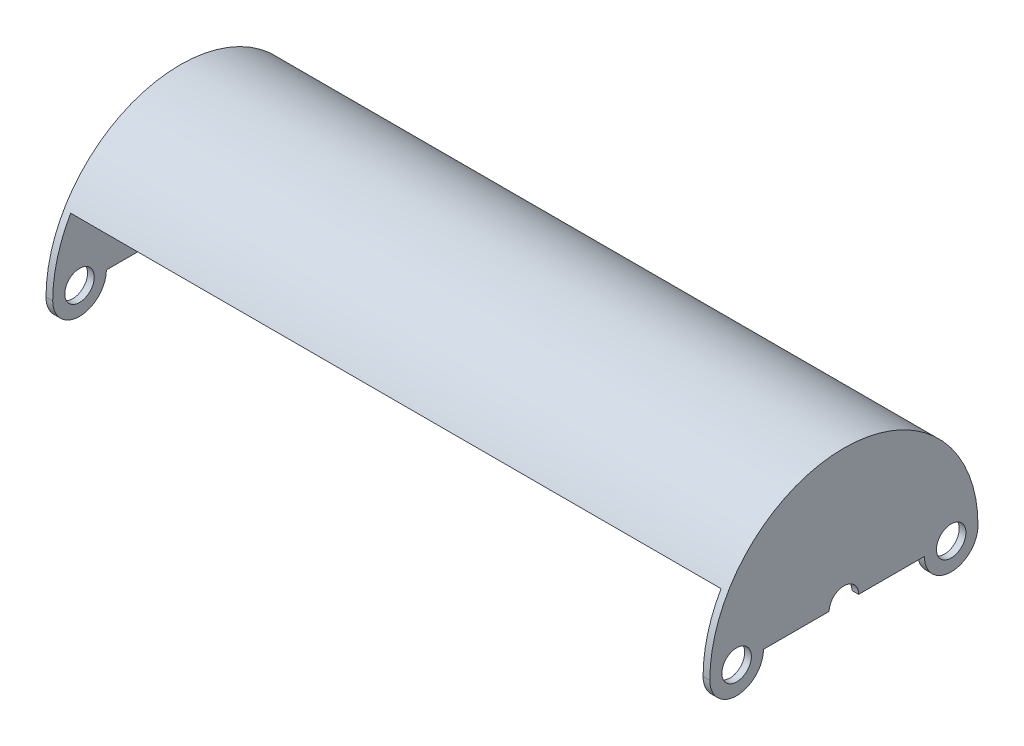
ISO-10303-21;
HEADER;
FILE_DESCRIPTION(('STEP AP214'),'2;1');
FILE_NAME('part.step','',(''),(''),'','','');
FILE_SCHEMA(('AUTOMOTIVE_DESIGN { 1 0 10303 214 1 1 1 1 }'));
ENDSEC;
DATA;
#1=APPLICATION_CONTEXT('core data for automotive mechanical design processes');
#2=APPLICATION_PROTOCOL_DEFINITION('international standard','automotive_design',2000,#1);
#3=PRODUCT_CONTEXT('',#1,'mechanical');
#4=PRODUCT('Part','Part','',(#3));
#5=PRODUCT_RELATED_PRODUCT_CATEGORY('part','',(#4));
#6=PRODUCT_DEFINITION_FORMATION('','',#4);
#7=PRODUCT_DEFINITION_CONTEXT('part definition',#1,'design');
#8=PRODUCT_DEFINITION('design','',#6,#7);
#9=PRODUCT_DEFINITION_SHAPE('','',#8);
#10=(LENGTH_UNIT() NAMED_UNIT(*) SI_UNIT(.MILLI.,.METRE.));
#11=(NAMED_UNIT(*) PLANE_ANGLE_UNIT() SI_UNIT($,.RADIAN.));
#12=(NAMED_UNIT(*) SI_UNIT($,.STERADIAN.) SOLID_ANGLE_UNIT());
#13=UNCERTAINTY_MEASURE_WITH_UNIT(LENGTH_MEASURE(1.E-05),#10,'distance_accuracy_value','');
#14=(GEOMETRIC_REPRESENTATION_CONTEXT(3) GLOBAL_UNCERTAINTY_ASSIGNED_CONTEXT((#13)) GLOBAL_UNIT_ASSIGNED_CONTEXT((#10,
#11,#12)) REPRESENTATION_CONTEXT('',''));
#15=CARTESIAN_POINT('',(0.,0.,0.));
#16=DIRECTION('',(0.,0.,1.));
#17=DIRECTION('',(1.,0.,0.));
#18=AXIS2_PLACEMENT_3D('',#15,#16,#17);
#19=CARTESIAN_POINT('',(76.99375,0.,0.));
#20=DIRECTION('',(-1.,0.,0.));
#21=DIRECTION('',(0.,0.,1.));
#22=AXIS2_PLACEMENT_3D('',#19,#20,#21);
#23=CYLINDRICAL_SURFACE('',#22,30.1625);
#24=CARTESIAN_POINT('',(-76.99375,0.,0.));
#25=DIRECTION('',(1.,0.,0.));
#26=DIRECTION('',(0.,0.,-1.));
#27=AXIS2_PLACEMENT_3D('',#24,#25,#26);
#28=CIRCLE('',#27,30.1625);
#29=CARTESIAN_POINT('',(-76.99375,0.,-30.1625));
#30=VERTEX_POINT('',#29);
#31=CARTESIAN_POINT('',(-76.99375,15.0812499999998,26.1214912416482));
#32=VERTEX_POINT('',#31);
#33=EDGE_CURVE('E306',#30,#32,#28,.T.);
#34=ORIENTED_EDGE('',*,*,#33,.F.);
#35=DIRECTION('',(-1.,0.,0.));
#36=VECTOR('',#35,1.);
#37=CARTESIAN_POINT('',(76.99375,0.,-30.1625));
#38=LINE('',#37,#36);
#39=CARTESIAN_POINT('',(76.99375,0.,-30.1625));
#40=VERTEX_POINT('',#39);
#41=EDGE_CURVE('E11',#40,#30,#38,.T.);
#42=ORIENTED_EDGE('',*,*,#41,.F.);
#43=CARTESIAN_POINT('',(76.99375,0.,0.));
#44=DIRECTION('',(1.,0.,0.));
#45=DIRECTION('',(0.,0.,-1.));
#46=AXIS2_PLACEMENT_3D('',#43,#44,#45);
#47=CIRCLE('',#46,30.1625);
#48=CARTESIAN_POINT('',(76.99375,15.0812499999998,26.1214912416482));
#49=VERTEX_POINT('',#48);
#50=EDGE_CURVE('E307',#40,#49,#47,.T.);
#51=ORIENTED_EDGE('',*,*,#50,.T.);
#52=DIRECTION('',(-1.,0.,0.));
#53=VECTOR('',#52,1.);
#54=CARTESIAN_POINT('',(76.99375,15.0812499999998,26.1214912416482));
#55=LINE('',#54,#53);
#56=EDGE_CURVE('E319',#49,#32,#55,.T.);
#57=ORIENTED_EDGE('',*,*,#56,.T.);
#58=EDGE_LOOP('',(#34,#42,#51,#57));
#59=FACE_BOUND('',#58,.T.);
#60=ADVANCED_FACE('F45',(#59),#23,.F.);
#61=CARTESIAN_POINT('',(76.99375,0.,0.));
#62=DIRECTION('',(0.,1.,0.));
#63=DIRECTION('',(0.,0.,1.));
#64=AXIS2_PLACEMENT_3D('',#61,#62,#63);
#65=PLANE('',#64);
#66=DIRECTION('',(0.,0.,-1.));
#67=VECTOR('',#66,1.);
#68=CARTESIAN_POINT('',(-76.99375,0.,0.));
#69=LINE('',#68,#67);
#70=CARTESIAN_POINT('',(-76.99375,0.,-31.75));
#71=VERTEX_POINT('',#70);
#72=EDGE_CURVE('E322',#30,#71,#69,.T.);
#73=ORIENTED_EDGE('',*,*,#72,.T.);
#74=DIRECTION('',(-1.,0.,0.));
#75=VECTOR('',#74,1.);
#76=CARTESIAN_POINT('',(76.99375,0.,-31.75));
#77=LINE('',#76,#75);
#78=CARTESIAN_POINT('',(76.99375,0.,-31.75));
#79=VERTEX_POINT('',#78);
#80=EDGE_CURVE('E54',#79,#71,#77,.T.);
#81=ORIENTED_EDGE('',*,*,#80,.F.);
#82=DIRECTION('',(0.,0.,-1.));
#83=VECTOR('',#82,1.);
#84=CARTESIAN_POINT('',(76.99375,0.,0.));
#85=LINE('',#84,#83);
#86=EDGE_CURVE('E311',#40,#79,#85,.T.);
#87=ORIENTED_EDGE('',*,*,#86,.F.);
#88=ORIENTED_EDGE('',*,*,#41,.T.);
#89=EDGE_LOOP('',(#73,#81,#87,#88));
#90=FACE_BOUND('',#89,.T.);
#91=ADVANCED_FACE('F340',(#90),#65,.F.);
#92=CARTESIAN_POINT('',(76.99375,0.,0.));
#93=DIRECTION('',(-1.,0.,0.));
#94=DIRECTION('',(0.,0.,1.));
#95=AXIS2_PLACEMENT_3D('',#92,#93,#94);
#96=CYLINDRICAL_SURFACE('',#95,31.75);
#97=ORIENTED_EDGE('',*,*,#80,.T.);
#98=DIRECTION('',(1.,0.,0.));
#99=VECTOR('',#98,1.);
#100=CARTESIAN_POINT('',(-78.58125,0.,-31.75));
#101=LINE('',#100,#99);
#102=CARTESIAN_POINT('',(-78.58125,0.,-31.75));
#103=VERTEX_POINT('',#102);
#104=EDGE_CURVE('E161',#103,#71,#101,.T.);
#105=ORIENTED_EDGE('',*,*,#104,.F.);
#106=CARTESIAN_POINT('',(-78.58125,0.,0.));
#107=DIRECTION('',(1.,0.,0.));
#108=DIRECTION('',(0.,0.,-1.));
#109=AXIS2_PLACEMENT_3D('',#106,#107,#108);
#110=CIRCLE('',#109,31.75);
#111=CARTESIAN_POINT('',(-78.58125,-2.78108394667497E-13,31.75));
#112=VERTEX_POINT('',#111);
#113=EDGE_CURVE('E167',#103,#112,#110,.T.);
#114=ORIENTED_EDGE('',*,*,#113,.T.);
#115=DIRECTION('',(1.,0.,0.));
#116=VECTOR('',#115,1.);
#117=CARTESIAN_POINT('',(-78.58125,-2.78108394667497E-13,31.75));
#118=LINE('',#117,#116);
#119=CARTESIAN_POINT('',(-76.99375,-2.78108394667497E-13,31.75));
#120=VERTEX_POINT('',#119);
#121=EDGE_CURVE('E149',#112,#120,#118,.T.);
#122=ORIENTED_EDGE('',*,*,#121,.T.);
#123=CARTESIAN_POINT('',(-76.99375,0.,0.));
#124=DIRECTION('',(1.,0.,0.));
#125=DIRECTION('',(0.,0.,-1.));
#126=AXIS2_PLACEMENT_3D('',#123,#124,#125);
#127=CIRCLE('',#126,31.75);
#128=CARTESIAN_POINT('',(-76.99375,15.8749999999998,27.496306570156));
#129=VERTEX_POINT('',#128);
#130=EDGE_CURVE('E198',#129,#120,#127,.T.);
#131=ORIENTED_EDGE('',*,*,#130,.F.);
#132=DIRECTION('',(-1.,0.,0.));
#133=VECTOR('',#132,1.);
#134=CARTESIAN_POINT('',(76.99375,15.8749999999998,27.496306570156));
#135=LINE('',#134,#133);
#136=CARTESIAN_POINT('',(76.99375,15.8749999999998,27.496306570156));
#137=VERTEX_POINT('',#136);
#138=EDGE_CURVE('E331',#137,#129,#135,.T.);
#139=ORIENTED_EDGE('',*,*,#138,.F.);
#140=CARTESIAN_POINT('',(76.99375,0.,0.));
#141=DIRECTION('',(1.,0.,0.));
#142=DIRECTION('',(0.,0.,-1.));
#143=AXIS2_PLACEMENT_3D('',#140,#141,#142);
#144=CIRCLE('',#143,31.75);
#145=CARTESIAN_POINT('',(76.99375,-2.78108394667497E-13,31.75));
#146=VERTEX_POINT('',#145);
#147=EDGE_CURVE('E60',#137,#146,#144,.T.);
#148=ORIENTED_EDGE('',*,*,#147,.T.);
#149=DIRECTION('',(-1.,0.,0.));
#150=VECTOR('',#149,1.);
#151=CARTESIAN_POINT('',(78.58125,-2.78108394667497E-13,31.75));
#152=LINE('',#151,#150);
#153=CARTESIAN_POINT('',(78.58125,-2.78108394667497E-13,31.75));
#154=VERTEX_POINT('',#153);
#155=EDGE_CURVE('E264',#154,#146,#152,.T.);
#156=ORIENTED_EDGE('',*,*,#155,.F.);
#157=CARTESIAN_POINT('',(78.58125,0.,0.));
#158=DIRECTION('',(1.,0.,0.));
#159=DIRECTION('',(0.,0.,-1.));
#160=AXIS2_PLACEMENT_3D('',#157,#158,#159);
#161=CIRCLE('',#160,31.75);
#162=CARTESIAN_POINT('',(78.58125,0.,-31.75));
#163=VERTEX_POINT('',#162);
#164=EDGE_CURVE('E261',#163,#154,#161,.T.);
#165=ORIENTED_EDGE('',*,*,#164,.F.);
#166=DIRECTION('',(-1.,0.,0.));
#167=VECTOR('',#166,1.);
#168=CARTESIAN_POINT('',(78.58125,0.,-31.75));
#169=LINE('',#168,#167);
#170=EDGE_CURVE('E286',#163,#79,#169,.T.);
#171=ORIENTED_EDGE('',*,*,#170,.T.);
#172=EDGE_LOOP('',(#97,#105,#114,#122,#131,#139,#148,#156,#165,#171));
#173=FACE_BOUND('',#172,.T.);
#174=ADVANCED_FACE('F176',(#173),#96,.T.);
#175=CARTESIAN_POINT('',(76.99375,0.,0.));
#176=DIRECTION('',(0.,-0.866025403784442,0.499999999999995));
#177=DIRECTION('',(0.,-0.499999999999995,-0.866025403784442));
#178=AXIS2_PLACEMENT_3D('',#175,#176,#177);
#179=PLANE('',#178);
#180=DIRECTION('',(0.,0.499999999999995,0.866025403784442));
#181=VECTOR('',#180,1.);
#182=CARTESIAN_POINT('',(-76.99375,0.,0.));
#183=LINE('',#182,#181);
#184=EDGE_CURVE('E312',#32,#129,#183,.T.);
#185=ORIENTED_EDGE('',*,*,#184,.F.);
#186=ORIENTED_EDGE('',*,*,#56,.F.);
#187=DIRECTION('',(0.,0.499999999999995,0.866025403784442));
#188=VECTOR('',#187,1.);
#189=CARTESIAN_POINT('',(76.99375,0.,0.));
#190=LINE('',#189,#188);
#191=EDGE_CURVE('E315',#49,#137,#190,.T.);
#192=ORIENTED_EDGE('',*,*,#191,.T.);
#193=ORIENTED_EDGE('',*,*,#138,.T.);
#194=EDGE_LOOP('',(#185,#186,#192,#193));
#195=FACE_BOUND('',#194,.T.);
#196=ADVANCED_FACE('F360',(#195),#179,.T.);
#197=CARTESIAN_POINT('',(78.58125,-2.24086679090653E-13,25.4));
#198=DIRECTION('',(1.,0.,0.));
#199=DIRECTION('',(0.,0.,-1.));
#200=AXIS2_PLACEMENT_3D('',#197,#198,#199);
#201=PLANE('',#200);
#202=CARTESIAN_POINT('',(78.58125,-2.24086679090653E-13,25.4));
#203=DIRECTION('',(1.,0.,0.));
#204=DIRECTION('',(0.,0.,-1.));
#205=AXIS2_PLACEMENT_3D('',#202,#203,#204);
#206=CIRCLE('',#205,3.4925);
#207=CARTESIAN_POINT('',(78.58125,-2.24086679090653E-13,21.9075));
#208=VERTEX_POINT('',#207);
#209=EDGE_CURVE('E237',#208,#208,#206,.T.);
#210=ORIENTED_EDGE('',*,*,#209,.F.);
#211=EDGE_LOOP('',(#210));
#212=FACE_BOUND('',#211,.T.);
#213=CARTESIAN_POINT('',(78.58125,-2.24086679090653E-13,25.4));
#214=DIRECTION('',(1.,0.,0.));
#215=DIRECTION('',(0.,0.,-1.));
#216=AXIS2_PLACEMENT_3D('',#213,#214,#215);
#217=CIRCLE('',#216,6.35);
#218=CARTESIAN_POINT('',(78.58125,-2.24086679090653E-13,19.05));
#219=VERTEX_POINT('',#218);
#220=EDGE_CURVE('E245',#154,#219,#217,.T.);
#221=ORIENTED_EDGE('',*,*,#220,.T.);
#222=DIRECTION('',(0.,0.,-1.));
#223=VECTOR('',#222,1.);
#224=CARTESIAN_POINT('',(78.58125,-2.24086679090653E-13,19.05));
#225=LINE('',#224,#223);
#226=CARTESIAN_POINT('',(78.58125,-1.32584618461969E-13,3.4925));
#227=VERTEX_POINT('',#226);
#228=EDGE_CURVE('E249',#219,#227,#225,.T.);
#229=ORIENTED_EDGE('',*,*,#228,.T.);
#230=CARTESIAN_POINT('',(78.58125,0.,0.));
#231=DIRECTION('',(-1.,0.,0.));
#232=DIRECTION('',(0.,0.,-1.));
#233=AXIS2_PLACEMENT_3D('',#230,#231,#232);
#234=CIRCLE('',#233,3.4925);
#235=CARTESIAN_POINT('',(78.58125,0.,-3.4925));
#236=VERTEX_POINT('',#235);
#237=EDGE_CURVE('E252',#227,#236,#234,.T.);
#238=ORIENTED_EDGE('',*,*,#237,.T.);
#239=DIRECTION('',(0.,0.,-1.));
#240=VECTOR('',#239,1.);
#241=CARTESIAN_POINT('',(78.58125,0.,-3.4925));
#242=LINE('',#241,#240);
#243=CARTESIAN_POINT('',(78.58125,0.,-19.05));
#244=VERTEX_POINT('',#243);
#245=EDGE_CURVE('E255',#236,#244,#242,.T.);
#246=ORIENTED_EDGE('',*,*,#245,.T.);
#247=CARTESIAN_POINT('',(78.58125,0.,-25.4));
#248=DIRECTION('',(1.,0.,0.));
#249=DIRECTION('',(0.,0.,-1.));
#250=AXIS2_PLACEMENT_3D('',#247,#248,#249);
#251=CIRCLE('',#250,6.35);
#252=EDGE_CURVE('E258',#244,#163,#251,.T.);
#253=ORIENTED_EDGE('',*,*,#252,.T.);
#254=ORIENTED_EDGE('',*,*,#164,.T.);
#255=EDGE_LOOP('',(#221,#229,#238,#246,#253,#254));
#256=FACE_BOUND('',#255,.T.);
#257=CARTESIAN_POINT('',(78.58125,0.,-25.4));
#258=DIRECTION('',(1.,0.,0.));
#259=DIRECTION('',(0.,0.,-1.));
#260=AXIS2_PLACEMENT_3D('',#257,#258,#259);
#261=CIRCLE('',#260,3.4925);
#262=CARTESIAN_POINT('',(78.58125,0.,-28.8925));
#263=VERTEX_POINT('',#262);
#264=EDGE_CURVE('E229',#263,#263,#261,.T.);
#265=ORIENTED_EDGE('',*,*,#264,.F.);
#266=EDGE_LOOP('',(#265));
#267=FACE_BOUND('',#266,.T.);
#268=ADVANCED_FACE('F378',(#212,#256,#267),#201,.T.);
#269=CARTESIAN_POINT('',(76.99375,-2.24086679090653E-13,25.4));
#270=DIRECTION('',(1.,0.,0.));
#271=DIRECTION('',(0.,0.,-1.));
#272=AXIS2_PLACEMENT_3D('',#269,#270,#271);
#273=PLANE('',#272);
#274=ORIENTED_EDGE('',*,*,#50,.F.);
#275=ORIENTED_EDGE('',*,*,#86,.T.);
#276=CARTESIAN_POINT('',(76.99375,0.,-25.4));
#277=DIRECTION('',(1.,0.,0.));
#278=DIRECTION('',(0.,0.,-1.));
#279=AXIS2_PLACEMENT_3D('',#276,#277,#278);
#280=CIRCLE('',#279,6.35);
#281=CARTESIAN_POINT('',(76.99375,0.,-19.05));
#282=VERTEX_POINT('',#281);
#283=EDGE_CURVE('E277',#282,#79,#280,.T.);
#284=ORIENTED_EDGE('',*,*,#283,.F.);
#285=DIRECTION('',(0.,0.,-1.));
#286=VECTOR('',#285,1.);
#287=CARTESIAN_POINT('',(76.99375,0.,-3.4925));
#288=LINE('',#287,#286);
#289=CARTESIAN_POINT('',(76.99375,0.,-3.4925));
#290=VERTEX_POINT('',#289);
#291=EDGE_CURVE('E274',#290,#282,#288,.T.);
#292=ORIENTED_EDGE('',*,*,#291,.F.);
#293=CARTESIAN_POINT('',(76.99375,0.,0.));
#294=DIRECTION('',(-1.,0.,0.));
#295=DIRECTION('',(0.,0.,-1.));
#296=AXIS2_PLACEMENT_3D('',#293,#294,#295);
#297=CIRCLE('',#296,3.4925);
#298=CARTESIAN_POINT('',(76.99375,-1.32584618461969E-13,3.4925));
#299=VERTEX_POINT('',#298);
#300=EDGE_CURVE('E271',#299,#290,#297,.T.);
#301=ORIENTED_EDGE('',*,*,#300,.F.);
#302=DIRECTION('',(0.,0.,-1.));
#303=VECTOR('',#302,1.);
#304=CARTESIAN_POINT('',(76.99375,-2.24086679090653E-13,19.05));
#305=LINE('',#304,#303);
#306=CARTESIAN_POINT('',(76.99375,-2.24086679090653E-13,19.05));
#307=VERTEX_POINT('',#306);
#308=EDGE_CURVE('E268',#307,#299,#305,.T.);
#309=ORIENTED_EDGE('',*,*,#308,.F.);
#310=CARTESIAN_POINT('',(76.99375,-2.24086679090653E-13,25.4));
#311=DIRECTION('',(1.,0.,0.));
#312=DIRECTION('',(0.,0.,-1.));
#313=AXIS2_PLACEMENT_3D('',#310,#311,#312);
#314=CIRCLE('',#313,6.35);
#315=EDGE_CURVE('E241',#146,#307,#314,.T.);
#316=ORIENTED_EDGE('',*,*,#315,.F.);
#317=ORIENTED_EDGE('',*,*,#147,.F.);
#318=ORIENTED_EDGE('',*,*,#191,.F.);
#319=EDGE_LOOP('',(#274,#275,#284,#292,#301,#309,#316,#317,#318));
#320=FACE_BOUND('',#319,.T.);
#321=CARTESIAN_POINT('',(76.99375,-2.24086679090653E-13,25.4));
#322=DIRECTION('',(1.,0.,0.));
#323=DIRECTION('',(0.,0.,-1.));
#324=AXIS2_PLACEMENT_3D('',#321,#322,#323);
#325=CIRCLE('',#324,3.4925);
#326=CARTESIAN_POINT('',(76.99375,-2.24086679090653E-13,21.9075));
#327=VERTEX_POINT('',#326);
#328=EDGE_CURVE('E233',#327,#327,#325,.T.);
#329=ORIENTED_EDGE('',*,*,#328,.T.);
#330=EDGE_LOOP('',(#329));
#331=FACE_BOUND('',#330,.T.);
#332=CARTESIAN_POINT('',(76.99375,0.,-25.4));
#333=DIRECTION('',(1.,0.,0.));
#334=DIRECTION('',(0.,0.,-1.));
#335=AXIS2_PLACEMENT_3D('',#332,#333,#334);
#336=CIRCLE('',#335,3.4925);
#337=CARTESIAN_POINT('',(76.99375,0.,-28.8925));
#338=VERTEX_POINT('',#337);
#339=EDGE_CURVE('E160',#338,#338,#336,.T.);
#340=ORIENTED_EDGE('',*,*,#339,.T.);
#341=EDGE_LOOP('',(#340));
#342=FACE_BOUND('',#341,.T.);
#343=ADVANCED_FACE('F362',(#320,#331,#342),#273,.F.);
#344=CARTESIAN_POINT('',(78.58125,-2.24086679090653E-13,25.4));
#345=DIRECTION('',(-1.,0.,0.));
#346=DIRECTION('',(0.,0.,1.));
#347=AXIS2_PLACEMENT_3D('',#344,#345,#346);
#348=CYLINDRICAL_SURFACE('',#347,6.35);
#349=ORIENTED_EDGE('',*,*,#315,.T.);
#350=DIRECTION('',(-1.,0.,0.));
#351=VECTOR('',#350,1.);
#352=CARTESIAN_POINT('',(78.58125,-2.24086679090653E-13,19.05));
#353=LINE('',#352,#351);
#354=EDGE_CURVE('E302',#219,#307,#353,.T.);
#355=ORIENTED_EDGE('',*,*,#354,.F.);
#356=ORIENTED_EDGE('',*,*,#220,.F.);
#357=ORIENTED_EDGE('',*,*,#155,.T.);
#358=EDGE_LOOP('',(#349,#355,#356,#357));
#359=FACE_BOUND('',#358,.T.);
#360=ADVANCED_FACE('F379',(#359),#348,.T.);
#361=CARTESIAN_POINT('',(78.58125,-2.24086679090653E-13,19.05));
#362=DIRECTION('',(0.,1.,0.));
#363=DIRECTION('',(0.,0.,1.));
#364=AXIS2_PLACEMENT_3D('',#361,#362,#363);
#365=PLANE('',#364);
#366=ORIENTED_EDGE('',*,*,#308,.T.);
#367=DIRECTION('',(-1.,0.,0.));
#368=VECTOR('',#367,1.);
#369=CARTESIAN_POINT('',(78.58125,-1.32584618461969E-13,3.4925));
#370=LINE('',#369,#368);
#371=EDGE_CURVE('E298',#227,#299,#370,.T.);
#372=ORIENTED_EDGE('',*,*,#371,.F.);
#373=ORIENTED_EDGE('',*,*,#228,.F.);
#374=ORIENTED_EDGE('',*,*,#354,.T.);
#375=EDGE_LOOP('',(#366,#372,#373,#374));
#376=FACE_BOUND('',#375,.T.);
#377=ADVANCED_FACE('F382',(#376),#365,.F.);
#378=CARTESIAN_POINT('',(78.58125,0.,0.));
#379=DIRECTION('',(-1.,0.,0.));
#380=DIRECTION('',(0.,0.,1.));
#381=AXIS2_PLACEMENT_3D('',#378,#379,#380);
#382=CYLINDRICAL_SURFACE('',#381,3.4925);
#383=ORIENTED_EDGE('',*,*,#300,.T.);
#384=DIRECTION('',(-1.,0.,0.));
#385=VECTOR('',#384,1.);
#386=CARTESIAN_POINT('',(78.58125,0.,-3.4925));
#387=LINE('',#386,#385);
#388=EDGE_CURVE('E294',#236,#290,#387,.T.);
#389=ORIENTED_EDGE('',*,*,#388,.F.);
#390=ORIENTED_EDGE('',*,*,#237,.F.);
#391=ORIENTED_EDGE('',*,*,#371,.T.);
#392=EDGE_LOOP('',(#383,#389,#390,#391));
#393=FACE_BOUND('',#392,.T.);
#394=ADVANCED_FACE('F386',(#393),#382,.F.);
#395=CARTESIAN_POINT('',(78.58125,0.,-3.4925));
#396=DIRECTION('',(0.,1.,0.));
#397=DIRECTION('',(0.,0.,1.));
#398=AXIS2_PLACEMENT_3D('',#395,#396,#397);
#399=PLANE('',#398);
#400=ORIENTED_EDGE('',*,*,#291,.T.);
#401=DIRECTION('',(-1.,0.,0.));
#402=VECTOR('',#401,1.);
#403=CARTESIAN_POINT('',(78.58125,0.,-19.05));
#404=LINE('',#403,#402);
#405=EDGE_CURVE('E290',#244,#282,#404,.T.);
#406=ORIENTED_EDGE('',*,*,#405,.F.);
#407=ORIENTED_EDGE('',*,*,#245,.F.);
#408=ORIENTED_EDGE('',*,*,#388,.T.);
#409=EDGE_LOOP('',(#400,#406,#407,#408));
#410=FACE_BOUND('',#409,.T.);
#411=ADVANCED_FACE('F390',(#410),#399,.F.);
#412=CARTESIAN_POINT('',(78.58125,0.,-25.4));
#413=DIRECTION('',(-1.,0.,0.));
#414=DIRECTION('',(0.,0.,1.));
#415=AXIS2_PLACEMENT_3D('',#412,#413,#414);
#416=CYLINDRICAL_SURFACE('',#415,6.35);
#417=ORIENTED_EDGE('',*,*,#283,.T.);
#418=ORIENTED_EDGE('',*,*,#170,.F.);
#419=ORIENTED_EDGE('',*,*,#252,.F.);
#420=ORIENTED_EDGE('',*,*,#405,.T.);
#421=EDGE_LOOP('',(#417,#418,#419,#420));
#422=FACE_BOUND('',#421,.T.);
#423=ADVANCED_FACE('F394',(#422),#416,.T.);
#424=CARTESIAN_POINT('',(78.58125,-2.24086679090653E-13,25.4));
#425=DIRECTION('',(-1.,0.,0.));
#426=DIRECTION('',(0.,0.,1.));
#427=AXIS2_PLACEMENT_3D('',#424,#425,#426);
#428=CYLINDRICAL_SURFACE('',#427,3.4925);
#429=ORIENTED_EDGE('',*,*,#209,.T.);
#430=EDGE_LOOP('',(#429));
#431=FACE_BOUND('',#430,.T.);
#432=ORIENTED_EDGE('',*,*,#328,.F.);
#433=EDGE_LOOP('',(#432));
#434=FACE_BOUND('',#433,.T.);
#435=ADVANCED_FACE('F398',(#431,#434),#428,.F.);
#436=CARTESIAN_POINT('',(78.58125,0.,-25.4));
#437=DIRECTION('',(-1.,0.,0.));
#438=DIRECTION('',(0.,0.,1.));
#439=AXIS2_PLACEMENT_3D('',#436,#437,#438);
#440=CYLINDRICAL_SURFACE('',#439,3.4925);
#441=ORIENTED_EDGE('',*,*,#264,.T.);
#442=EDGE_LOOP('',(#441));
#443=FACE_BOUND('',#442,.T.);
#444=ORIENTED_EDGE('',*,*,#339,.F.);
#445=EDGE_LOOP('',(#444));
#446=FACE_BOUND('',#445,.T.);
#447=ADVANCED_FACE('F407',(#443,#446),#440,.F.);
#448=CARTESIAN_POINT('',(-76.99375,-2.24086679090653E-13,25.4));
#449=DIRECTION('',(-1.,0.,0.));
#450=DIRECTION('',(0.,0.,-1.));
#451=AXIS2_PLACEMENT_3D('',#448,#449,#450);
#452=PLANE('',#451);
#453=CARTESIAN_POINT('',(-76.99375,0.,-25.4));
#454=DIRECTION('',(1.,0.,0.));
#455=DIRECTION('',(0.,0.,-1.));
#456=AXIS2_PLACEMENT_3D('',#453,#454,#455);
#457=CIRCLE('',#456,3.4925);
#458=CARTESIAN_POINT('',(-76.99375,0.,-28.8925));
#459=VERTEX_POINT('',#458);
#460=EDGE_CURVE('E442',#459,#459,#457,.T.);
#461=ORIENTED_EDGE('',*,*,#460,.F.);
#462=EDGE_LOOP('',(#461));
#463=FACE_BOUND('',#462,.T.);
#464=CARTESIAN_POINT('',(-76.99375,-2.24086679090653E-13,25.4));
#465=DIRECTION('',(1.,0.,0.));
#466=DIRECTION('',(0.,0.,-1.));
#467=AXIS2_PLACEMENT_3D('',#464,#465,#466);
#468=CIRCLE('',#467,3.4925);
#469=CARTESIAN_POINT('',(-76.99375,-2.24086679090653E-13,21.9075));
#470=VERTEX_POINT('',#469);
#471=EDGE_CURVE('E446',#470,#470,#468,.T.);
#472=ORIENTED_EDGE('',*,*,#471,.F.);
#473=EDGE_LOOP('',(#472));
#474=FACE_BOUND('',#473,.T.);
#475=ORIENTED_EDGE('',*,*,#33,.T.);
#476=ORIENTED_EDGE('',*,*,#184,.T.);
#477=ORIENTED_EDGE('',*,*,#130,.T.);
#478=CARTESIAN_POINT('',(-76.99375,-2.24086679090653E-13,25.4));
#479=DIRECTION('',(1.,0.,0.));
#480=DIRECTION('',(0.,0.,-1.));
#481=AXIS2_PLACEMENT_3D('',#478,#479,#480);
#482=CIRCLE('',#481,6.35);
#483=CARTESIAN_POINT('',(-76.99375,-2.24086679090653E-13,19.05));
#484=VERTEX_POINT('',#483);
#485=EDGE_CURVE('E155',#120,#484,#482,.T.);
#486=ORIENTED_EDGE('',*,*,#485,.T.);
#487=DIRECTION('',(0.,0.,-1.));
#488=VECTOR('',#487,1.);
#489=CARTESIAN_POINT('',(-76.99375,-2.24086679090653E-13,19.05));
#490=LINE('',#489,#488);
#491=CARTESIAN_POINT('',(-76.99375,-1.32584618461969E-13,3.4925));
#492=VERTEX_POINT('',#491);
#493=EDGE_CURVE('E173',#484,#492,#490,.T.);
#494=ORIENTED_EDGE('',*,*,#493,.T.);
#495=CARTESIAN_POINT('',(-76.99375,0.,0.));
#496=DIRECTION('',(-1.,0.,0.));
#497=DIRECTION('',(0.,0.,-1.));
#498=AXIS2_PLACEMENT_3D('',#495,#496,#497);
#499=CIRCLE('',#498,3.4925);
#500=CARTESIAN_POINT('',(-76.99375,0.,-3.4925));
#501=VERTEX_POINT('',#500);
#502=EDGE_CURVE('E209',#492,#501,#499,.T.);
#503=ORIENTED_EDGE('',*,*,#502,.T.);
#504=DIRECTION('',(0.,0.,-1.));
#505=VECTOR('',#504,1.);
#506=CARTESIAN_POINT('',(-76.99375,0.,-3.4925));
#507=LINE('',#506,#505);
#508=CARTESIAN_POINT('',(-76.99375,0.,-19.05));
#509=VERTEX_POINT('',#508);
#510=EDGE_CURVE('E205',#501,#509,#507,.T.);
#511=ORIENTED_EDGE('',*,*,#510,.T.);
#512=CARTESIAN_POINT('',(-76.99375,0.,-25.4));
#513=DIRECTION('',(1.,0.,0.));
#514=DIRECTION('',(0.,0.,-1.));
#515=AXIS2_PLACEMENT_3D('',#512,#513,#514);
#516=CIRCLE('',#515,6.35);
#517=EDGE_CURVE('E202',#509,#71,#516,.T.);
#518=ORIENTED_EDGE('',*,*,#517,.T.);
#519=ORIENTED_EDGE('',*,*,#72,.F.);
#520=EDGE_LOOP('',(#475,#476,#477,#486,#494,#503,#511,#518,#519));
#521=FACE_BOUND('',#520,.T.);
#522=ADVANCED_FACE('F344',(#463,#474,#521),#452,.F.);
#523=CARTESIAN_POINT('',(-78.58125,-2.24086679090653E-13,25.4));
#524=DIRECTION('',(1.,0.,0.));
#525=DIRECTION('',(0.,0.,-1.));
#526=AXIS2_PLACEMENT_3D('',#523,#524,#525);
#527=CYLINDRICAL_SURFACE('',#526,6.35);
#528=ORIENTED_EDGE('',*,*,#485,.F.);
#529=ORIENTED_EDGE('',*,*,#121,.F.);
#530=CARTESIAN_POINT('',(-78.58125,-2.24086679090653E-13,25.4));
#531=DIRECTION('',(1.,0.,0.));
#532=DIRECTION('',(0.,0.,-1.));
#533=AXIS2_PLACEMENT_3D('',#530,#531,#532);
#534=CIRCLE('',#533,6.35);
#535=CARTESIAN_POINT('',(-78.58125,-2.24086679090653E-13,19.05));
#536=VERTEX_POINT('',#535);
#537=EDGE_CURVE('E152',#112,#536,#534,.T.);
#538=ORIENTED_EDGE('',*,*,#537,.T.);
#539=DIRECTION('',(1.,0.,0.));
#540=VECTOR('',#539,1.);
#541=CARTESIAN_POINT('',(-78.58125,-2.24086679090653E-13,19.05));
#542=LINE('',#541,#540);
#543=EDGE_CURVE('E195',#536,#484,#542,.T.);
#544=ORIENTED_EDGE('',*,*,#543,.T.);
#545=EDGE_LOOP('',(#528,#529,#538,#544));
#546=FACE_BOUND('',#545,.T.);
#547=ADVANCED_FACE('F151',(#546),#527,.T.);
#548=CARTESIAN_POINT('',(-78.58125,0.,-25.4));
#549=DIRECTION('',(1.,0.,0.));
#550=DIRECTION('',(0.,0.,-1.));
#551=AXIS2_PLACEMENT_3D('',#548,#549,#550);
#552=CYLINDRICAL_SURFACE('',#551,6.35);
#553=ORIENTED_EDGE('',*,*,#517,.F.);
#554=DIRECTION('',(1.,0.,0.));
#555=VECTOR('',#554,1.);
#556=CARTESIAN_POINT('',(-78.58125,0.,-19.05));
#557=LINE('',#556,#555);
#558=CARTESIAN_POINT('',(-78.58125,0.,-19.05));
#559=VERTEX_POINT('',#558);
#560=EDGE_CURVE('E224',#559,#509,#557,.T.);
#561=ORIENTED_EDGE('',*,*,#560,.F.);
#562=CARTESIAN_POINT('',(-78.58125,0.,-25.4));
#563=DIRECTION('',(1.,0.,0.));
#564=DIRECTION('',(0.,0.,-1.));
#565=AXIS2_PLACEMENT_3D('',#562,#563,#564);
#566=CIRCLE('',#565,6.35);
#567=EDGE_CURVE('E179',#559,#103,#566,.T.);
#568=ORIENTED_EDGE('',*,*,#567,.T.);
#569=ORIENTED_EDGE('',*,*,#104,.T.);
#570=EDGE_LOOP('',(#553,#561,#568,#569));
#571=FACE_BOUND('',#570,.T.);
#572=ADVANCED_FACE('F348',(#571),#552,.T.);
#573=CARTESIAN_POINT('',(-78.58125,0.,-3.4925));
#574=DIRECTION('',(0.,-1.,0.));
#575=DIRECTION('',(0.,0.,-1.));
#576=AXIS2_PLACEMENT_3D('',#573,#574,#575);
#577=PLANE('',#576);
#578=ORIENTED_EDGE('',*,*,#510,.F.);
#579=DIRECTION('',(1.,0.,0.));
#580=VECTOR('',#579,1.);
#581=CARTESIAN_POINT('',(-78.58125,0.,-3.4925));
#582=LINE('',#581,#580);
#583=CARTESIAN_POINT('',(-78.58125,0.,-3.4925));
#584=VERTEX_POINT('',#583);
#585=EDGE_CURVE('E221',#584,#501,#582,.T.);
#586=ORIENTED_EDGE('',*,*,#585,.F.);
#587=DIRECTION('',(0.,0.,-1.));
#588=VECTOR('',#587,1.);
#589=CARTESIAN_POINT('',(-78.58125,0.,-3.4925));
#590=LINE('',#589,#588);
#591=EDGE_CURVE('E182',#584,#559,#590,.T.);
#592=ORIENTED_EDGE('',*,*,#591,.T.);
#593=ORIENTED_EDGE('',*,*,#560,.T.);
#594=EDGE_LOOP('',(#578,#586,#592,#593));
#595=FACE_BOUND('',#594,.T.);
#596=ADVANCED_FACE('F351',(#595),#577,.T.);
#597=CARTESIAN_POINT('',(-78.58125,0.,0.));
#598=DIRECTION('',(1.,0.,0.));
#599=DIRECTION('',(0.,0.,-1.));
#600=AXIS2_PLACEMENT_3D('',#597,#598,#599);
#601=CYLINDRICAL_SURFACE('',#600,3.4925);
#602=ORIENTED_EDGE('',*,*,#502,.F.);
#603=DIRECTION('',(1.,0.,0.));
#604=VECTOR('',#603,1.);
#605=CARTESIAN_POINT('',(-78.58125,-1.32584618461969E-13,3.4925));
#606=LINE('',#605,#604);
#607=CARTESIAN_POINT('',(-78.58125,-1.32584618461969E-13,3.4925));
#608=VERTEX_POINT('',#607);
#609=EDGE_CURVE('E218',#608,#492,#606,.T.);
#610=ORIENTED_EDGE('',*,*,#609,.F.);
#611=CARTESIAN_POINT('',(-78.58125,0.,0.));
#612=DIRECTION('',(-1.,0.,0.));
#613=DIRECTION('',(0.,0.,-1.));
#614=AXIS2_PLACEMENT_3D('',#611,#612,#613);
#615=CIRCLE('',#614,3.4925);
#616=EDGE_CURVE('E189',#608,#584,#615,.T.);
#617=ORIENTED_EDGE('',*,*,#616,.T.);
#618=ORIENTED_EDGE('',*,*,#585,.T.);
#619=EDGE_LOOP('',(#602,#610,#617,#618));
#620=FACE_BOUND('',#619,.T.);
#621=ADVANCED_FACE('F354',(#620),#601,.F.);
#622=CARTESIAN_POINT('',(-78.58125,-2.24086679090653E-13,19.05));
#623=DIRECTION('',(0.,-1.,0.));
#624=DIRECTION('',(0.,0.,-1.));
#625=AXIS2_PLACEMENT_3D('',#622,#623,#624);
#626=PLANE('',#625);
#627=ORIENTED_EDGE('',*,*,#493,.F.);
#628=ORIENTED_EDGE('',*,*,#543,.F.);
#629=DIRECTION('',(0.,0.,-1.));
#630=VECTOR('',#629,1.);
#631=CARTESIAN_POINT('',(-78.58125,-2.24086679090653E-13,19.05));
#632=LINE('',#631,#630);
#633=EDGE_CURVE('E171',#536,#608,#632,.T.);
#634=ORIENTED_EDGE('',*,*,#633,.T.);
#635=ORIENTED_EDGE('',*,*,#609,.T.);
#636=EDGE_LOOP('',(#627,#628,#634,#635));
#637=FACE_BOUND('',#636,.T.);
#638=ADVANCED_FACE('F357',(#637),#626,.T.);
#639=CARTESIAN_POINT('',(-78.58125,-2.24086679090653E-13,25.4));
#640=DIRECTION('',(-1.,0.,0.));
#641=DIRECTION('',(0.,0.,-1.));
#642=AXIS2_PLACEMENT_3D('',#639,#640,#641);
#643=PLANE('',#642);
#644=CARTESIAN_POINT('',(-78.58125,0.,-25.4));
#645=DIRECTION('',(1.,0.,0.));
#646=DIRECTION('',(0.,0.,-1.));
#647=AXIS2_PLACEMENT_3D('',#644,#645,#646);
#648=CIRCLE('',#647,3.4925);
#649=CARTESIAN_POINT('',(-78.58125,0.,-28.8925));
#650=VERTEX_POINT('',#649);
#651=EDGE_CURVE('E439',#650,#650,#648,.T.);
#652=ORIENTED_EDGE('',*,*,#651,.T.);
#653=EDGE_LOOP('',(#652));
#654=FACE_BOUND('',#653,.T.);
#655=CARTESIAN_POINT('',(-78.58125,-2.24086679090653E-13,25.4));
#656=DIRECTION('',(1.,0.,0.));
#657=DIRECTION('',(0.,0.,-1.));
#658=AXIS2_PLACEMENT_3D('',#655,#656,#657);
#659=CIRCLE('',#658,3.4925);
#660=CARTESIAN_POINT('',(-78.58125,-2.24086679090653E-13,21.9075));
#661=VERTEX_POINT('',#660);
#662=EDGE_CURVE('E199',#661,#661,#659,.T.);
#663=ORIENTED_EDGE('',*,*,#662,.T.);
#664=EDGE_LOOP('',(#663));
#665=FACE_BOUND('',#664,.T.);
#666=ORIENTED_EDGE('',*,*,#537,.F.);
#667=ORIENTED_EDGE('',*,*,#113,.F.);
#668=ORIENTED_EDGE('',*,*,#567,.F.);
#669=ORIENTED_EDGE('',*,*,#591,.F.);
#670=ORIENTED_EDGE('',*,*,#616,.F.);
#671=ORIENTED_EDGE('',*,*,#633,.F.);
#672=EDGE_LOOP('',(#666,#667,#668,#669,#670,#671));
#673=FACE_BOUND('',#672,.T.);
#674=ADVANCED_FACE('F165',(#654,#665,#673),#643,.T.);
#675=CARTESIAN_POINT('',(-78.58125,-2.24086679090653E-13,25.4));
#676=DIRECTION('',(1.,0.,0.));
#677=DIRECTION('',(0.,0.,-1.));
#678=AXIS2_PLACEMENT_3D('',#675,#676,#677);
#679=CYLINDRICAL_SURFACE('',#678,3.4925);
#680=ORIENTED_EDGE('',*,*,#662,.F.);
#681=EDGE_LOOP('',(#680));
#682=FACE_BOUND('',#681,.T.);
#683=ORIENTED_EDGE('',*,*,#471,.T.);
#684=EDGE_LOOP('',(#683));
#685=FACE_BOUND('',#684,.T.);
#686=ADVANCED_FACE('F426',(#682,#685),#679,.F.);
#687=CARTESIAN_POINT('',(-78.58125,0.,-25.4));
#688=DIRECTION('',(1.,0.,0.));
#689=DIRECTION('',(0.,0.,-1.));
#690=AXIS2_PLACEMENT_3D('',#687,#688,#689);
#691=CYLINDRICAL_SURFACE('',#690,3.4925);
#692=ORIENTED_EDGE('',*,*,#651,.F.);
#693=EDGE_LOOP('',(#692));
#694=FACE_BOUND('',#693,.T.);
#695=ORIENTED_EDGE('',*,*,#460,.T.);
#696=EDGE_LOOP('',(#695));
#697=FACE_BOUND('',#696,.T.);
#698=ADVANCED_FACE('F430',(#694,#697),#691,.F.);
#699=CLOSED_SHELL('',(#60,#91,#174,#196,#268,#343,#360,#377,#394,#411,#423,#435,#447,#522,#547,
#572,#596,#621,#638,#674,#686,#698));
#700=MANIFOLD_SOLID_BREP('B2',#699);
#701=ADVANCED_BREP_SHAPE_REPRESENTATION('',(#18,#700),#14);
#702=SHAPE_DEFINITION_REPRESENTATION(#9,#701);
ENDSEC;
END-ISO-10303-21;
